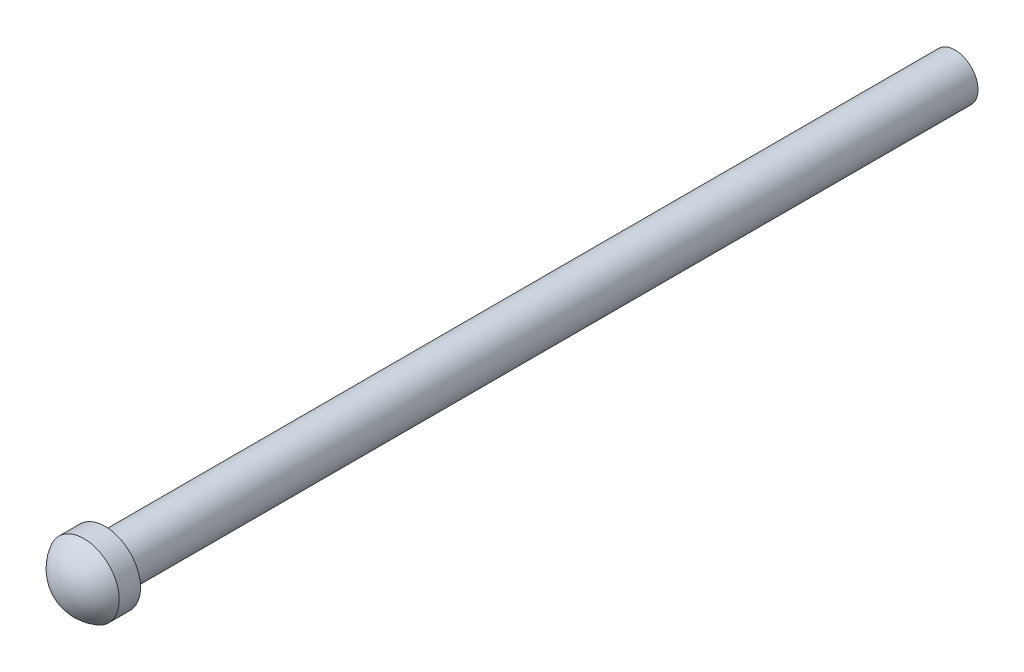
ISO-10303-21;
HEADER;
FILE_DESCRIPTION(('STEP AP214'),'2;1');
FILE_NAME('part.step','',(''),(''),'','','');
FILE_SCHEMA(('AUTOMOTIVE_DESIGN { 1 0 10303 214 1 1 1 1 }'));
ENDSEC;
DATA;
#1=APPLICATION_CONTEXT('core data for automotive mechanical design processes');
#2=APPLICATION_PROTOCOL_DEFINITION('international standard','automotive_design',2000,#1);
#3=PRODUCT_CONTEXT('',#1,'mechanical');
#4=PRODUCT('Part','Part','',(#3));
#5=PRODUCT_RELATED_PRODUCT_CATEGORY('part','',(#4));
#6=PRODUCT_DEFINITION_FORMATION('','',#4);
#7=PRODUCT_DEFINITION_CONTEXT('part definition',#1,'design');
#8=PRODUCT_DEFINITION('design','',#6,#7);
#9=PRODUCT_DEFINITION_SHAPE('','',#8);
#10=(LENGTH_UNIT() NAMED_UNIT(*) SI_UNIT(.MILLI.,.METRE.));
#11=(NAMED_UNIT(*) PLANE_ANGLE_UNIT() SI_UNIT($,.RADIAN.));
#12=(NAMED_UNIT(*) SI_UNIT($,.STERADIAN.) SOLID_ANGLE_UNIT());
#13=UNCERTAINTY_MEASURE_WITH_UNIT(LENGTH_MEASURE(1.E-05),#10,'distance_accuracy_value','');
#14=(GEOMETRIC_REPRESENTATION_CONTEXT(3) GLOBAL_UNCERTAINTY_ASSIGNED_CONTEXT((#13)) GLOBAL_UNIT_ASSIGNED_CONTEXT((#10,
#11,#12)) REPRESENTATION_CONTEXT('',''));
#15=CARTESIAN_POINT('',(0.,0.,0.));
#16=DIRECTION('',(0.,0.,1.));
#17=DIRECTION('',(1.,0.,0.));
#18=AXIS2_PLACEMENT_3D('',#15,#16,#17);
#19=CARTESIAN_POINT('',(5.,60.,-120.));
#20=DIRECTION('',(0.,0.,1.));
#21=DIRECTION('',(1.,0.,0.));
#22=AXIS2_PLACEMENT_3D('',#19,#20,#21);
#23=CYLINDRICAL_SURFACE('',#22,3.25);
#24=CARTESIAN_POINT('',(5.,60.,-120.));
#25=DIRECTION('',(0.,0.,1.));
#26=DIRECTION('',(1.,0.,0.));
#27=AXIS2_PLACEMENT_3D('',#24,#25,#26);
#28=CIRCLE('',#27,3.25);
#29=CARTESIAN_POINT('',(8.25,60.,-120.));
#30=VERTEX_POINT('',#29);
#31=EDGE_CURVE('E10',#30,#30,#28,.T.);
#32=ORIENTED_EDGE('',*,*,#31,.T.);
#33=EDGE_LOOP('',(#32));
#34=FACE_BOUND('',#33,.T.);
#35=CARTESIAN_POINT('',(5.,60.,0.));
#36=DIRECTION('',(0.,0.,1.));
#37=DIRECTION('',(1.,0.,0.));
#38=AXIS2_PLACEMENT_3D('',#35,#36,#37);
#39=CIRCLE('',#38,3.25);
#40=CARTESIAN_POINT('',(8.25,60.,0.));
#41=VERTEX_POINT('',#40);
#42=EDGE_CURVE('E39',#41,#41,#39,.T.);
#43=ORIENTED_EDGE('',*,*,#42,.F.);
#44=EDGE_LOOP('',(#43));
#45=FACE_BOUND('',#44,.T.);
#46=ADVANCED_FACE('F31',(#34,#45),#23,.T.);
#47=CARTESIAN_POINT('',(5.,60.,-120.));
#48=DIRECTION('',(0.,0.,1.));
#49=DIRECTION('',(1.,0.,0.));
#50=AXIS2_PLACEMENT_3D('',#47,#48,#49);
#51=PLANE('',#50);
#52=ORIENTED_EDGE('',*,*,#31,.F.);
#53=EDGE_LOOP('',(#52));
#54=FACE_BOUND('',#53,.T.);
#55=ADVANCED_FACE('F55',(#54),#51,.F.);
#56=CARTESIAN_POINT('',(5.,60.,3.));
#57=DIRECTION('',(0.,0.,-1.));
#58=DIRECTION('',(-1.,0.,0.));
#59=AXIS2_PLACEMENT_3D('',#56,#57,#58);
#60=CYLINDRICAL_SURFACE('',#59,5.00000000000002);
#61=CARTESIAN_POINT('',(5.,60.,3.));
#62=DIRECTION('',(0.,0.,1.));
#63=DIRECTION('',(1.,0.,0.));
#64=AXIS2_PLACEMENT_3D('',#61,#62,#63);
#65=CIRCLE('',#64,5.00000000000002);
#66=CARTESIAN_POINT('',(10.,60.,3.));
#67=VERTEX_POINT('',#66);
#68=EDGE_CURVE('E35',#67,#67,#65,.T.);
#69=ORIENTED_EDGE('',*,*,#68,.F.);
#70=EDGE_LOOP('',(#69));
#71=FACE_BOUND('',#70,.T.);
#72=CARTESIAN_POINT('',(5.,60.,0.));
#73=DIRECTION('',(0.,0.,1.));
#74=DIRECTION('',(1.,0.,0.));
#75=AXIS2_PLACEMENT_3D('',#72,#73,#74);
#76=CIRCLE('',#75,5.00000000000002);
#77=CARTESIAN_POINT('',(10.,60.,0.));
#78=VERTEX_POINT('',#77);
#79=EDGE_CURVE('E45',#78,#78,#76,.T.);
#80=ORIENTED_EDGE('',*,*,#79,.T.);
#81=EDGE_LOOP('',(#80));
#82=FACE_BOUND('',#81,.T.);
#83=ADVANCED_FACE('F53',(#71,#82),#60,.T.);
#84=CARTESIAN_POINT('',(5.,60.,0.333333333333295));
#85=DIRECTION('',(0.,0.,1.));
#86=DIRECTION('',(1.,0.,0.));
#87=AXIS2_PLACEMENT_3D('',#84,#85,#86);
#88=SPHERICAL_SURFACE('',#87,5.66666666666671);
#89=ORIENTED_EDGE('',*,*,#68,.T.);
#90=EDGE_LOOP('',(#89));
#91=FACE_BOUND('',#90,.T.);
#92=ADVANCED_FACE('F33',(#91),#88,.T.);
#93=CARTESIAN_POINT('',(5.,60.,0.));
#94=DIRECTION('',(0.,0.,1.));
#95=DIRECTION('',(1.,0.,0.));
#96=AXIS2_PLACEMENT_3D('',#93,#94,#95);
#97=PLANE('',#96);
#98=ORIENTED_EDGE('',*,*,#42,.T.);
#99=EDGE_LOOP('',(#98));
#100=FACE_BOUND('',#99,.T.);
#101=ORIENTED_EDGE('',*,*,#79,.F.);
#102=EDGE_LOOP('',(#101));
#103=FACE_BOUND('',#102,.T.);
#104=ADVANCED_FACE('F61',(#100,#103),#97,.F.);
#105=CLOSED_SHELL('',(#46,#55,#83,#92,#104));
#106=MANIFOLD_SOLID_BREP('B2',#105);
#107=ADVANCED_BREP_SHAPE_REPRESENTATION('',(#18,#106),#14);
#108=SHAPE_DEFINITION_REPRESENTATION(#9,#107);
ENDSEC;
END-ISO-10303-21;
